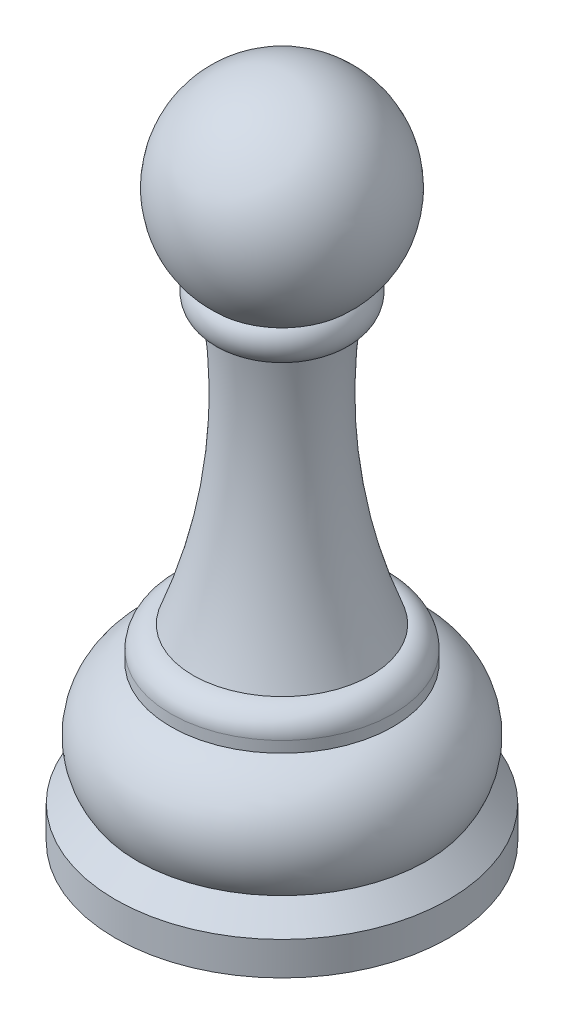
ISO-10303-21;
HEADER;
FILE_DESCRIPTION(('STEP AP214'),'2;1');
FILE_NAME('part.step','',(''),(''),'','','');
FILE_SCHEMA(('AUTOMOTIVE_DESIGN { 1 0 10303 214 1 1 1 1 }'));
ENDSEC;
DATA;
#1=APPLICATION_CONTEXT('core data for automotive mechanical design processes');
#2=APPLICATION_PROTOCOL_DEFINITION('international standard','automotive_design',2000,#1);
#3=PRODUCT_CONTEXT('',#1,'mechanical');
#4=PRODUCT('Part','Part','',(#3));
#5=PRODUCT_RELATED_PRODUCT_CATEGORY('part','',(#4));
#6=PRODUCT_DEFINITION_FORMATION('','',#4);
#7=PRODUCT_DEFINITION_CONTEXT('part definition',#1,'design');
#8=PRODUCT_DEFINITION('design','',#6,#7);
#9=PRODUCT_DEFINITION_SHAPE('','',#8);
#10=(LENGTH_UNIT() NAMED_UNIT(*) SI_UNIT(.MILLI.,.METRE.));
#11=(NAMED_UNIT(*) PLANE_ANGLE_UNIT() SI_UNIT($,.RADIAN.));
#12=(NAMED_UNIT(*) SI_UNIT($,.STERADIAN.) SOLID_ANGLE_UNIT());
#13=UNCERTAINTY_MEASURE_WITH_UNIT(LENGTH_MEASURE(1.E-05),#10,'distance_accuracy_value','');
#14=(GEOMETRIC_REPRESENTATION_CONTEXT(3) GLOBAL_UNCERTAINTY_ASSIGNED_CONTEXT((#13)) GLOBAL_UNIT_ASSIGNED_CONTEXT((#10,
#11,#12)) REPRESENTATION_CONTEXT('',''));
#15=CARTESIAN_POINT('',(0.,0.,0.));
#16=DIRECTION('',(0.,0.,1.));
#17=DIRECTION('',(1.,0.,0.));
#18=AXIS2_PLACEMENT_3D('',#15,#16,#17);
#19=CARTESIAN_POINT('',(0.,51.000000224209,0.0020089203871124));
#20=DIRECTION('',(-1.,0.,0.));
#21=DIRECTION('',(0.,0.,1.));
#22=AXIS2_PLACEMENT_3D('',#19,#20,#21);
#23=CIRCLE('',#22,9.);
#24=TRIMMED_CURVE('',#23,(PARAMETER_VALUE(-1.5710195401731)),(PARAMETER_VALUE(1.5710195401731)),
.T.,.PARAMETER.);
#25=CARTESIAN_POINT('',(0.,51.000000224209,0.));
#26=DIRECTION('',(0.,1.,0.));
#27=AXIS1_PLACEMENT('',#25,#26);
#28=SURFACE_OF_REVOLUTION('',#24,#27);
#29=CARTESIAN_POINT('',(0.,60.,0.));
#30=VERTEX_POINT('',#29);
#31=VERTEX_LOOP('',#30);
#32=FACE_BOUND('',#31,.T.);
#33=CARTESIAN_POINT('',(0.,44.29,0.));
#34=DIRECTION('',(0.,1.,0.));
#35=DIRECTION('',(0.,0.,1.));
#36=AXIS2_PLACEMENT_3D('',#33,#34,#35);
#37=CIRCLE('',#36,6.);
#38=CARTESIAN_POINT('',(0.,44.29,6.));
#39=VERTEX_POINT('',#38);
#40=EDGE_CURVE('E11',#39,#39,#37,.T.);
#41=ORIENTED_EDGE('',*,*,#40,.T.);
#42=EDGE_LOOP('',(#41));
#43=FACE_BOUND('',#42,.T.);
#44=ADVANCED_FACE('F34',(#32,#43),#28,.T.);
#45=CARTESIAN_POINT('',(0.,42.966609004825,0.));
#46=DIRECTION('',(0.,1.,0.));
#47=DIRECTION('',(0.,0.,1.));
#48=AXIS2_PLACEMENT_3D('',#45,#46,#47);
#49=TOROIDAL_SURFACE('',#48,4.50045464427058,2.);
#50=ORIENTED_EDGE('',*,*,#40,.F.);
#51=EDGE_LOOP('',(#50));
#52=FACE_BOUND('',#51,.T.);
#53=CARTESIAN_POINT('',(0.,41.03,0.));
#54=DIRECTION('',(0.,1.,0.));
#55=DIRECTION('',(0.,0.,1.));
#56=AXIS2_PLACEMENT_3D('',#53,#54,#55);
#57=CIRCLE('',#56,5.);
#58=CARTESIAN_POINT('',(0.,41.03,5.));
#59=VERTEX_POINT('',#58);
#60=EDGE_CURVE('E40',#59,#59,#57,.T.);
#61=ORIENTED_EDGE('',*,*,#60,.T.);
#62=EDGE_LOOP('',(#61));
#63=FACE_BOUND('',#62,.T.);
#64=ADVANCED_FACE('F45',(#52,#63),#49,.T.);
#65=CARTESIAN_POINT('',(0.,35.0019065796665,0.));
#66=DIRECTION('',(0.,1.,0.));
#67=DIRECTION('',(0.,0.,1.));
#68=AXIS2_PLACEMENT_3D('',#65,#66,#67);
#69=TOROIDAL_SURFACE('',#68,54.635290768925,50.);
#70=ORIENTED_EDGE('',*,*,#60,.F.);
#71=EDGE_LOOP('',(#70));
#72=FACE_BOUND('',#71,.T.);
#73=CARTESIAN_POINT('',(0.,16.97,0.));
#74=DIRECTION('',(0.,1.,0.));
#75=DIRECTION('',(0.,0.,1.));
#76=AXIS2_PLACEMENT_3D('',#73,#74,#75);
#77=CIRCLE('',#76,8.);
#78=CARTESIAN_POINT('',(0.,16.97,8.));
#79=VERTEX_POINT('',#78);
#80=EDGE_CURVE('E54',#79,#79,#77,.T.);
#81=ORIENTED_EDGE('',*,*,#80,.T.);
#82=EDGE_LOOP('',(#81));
#83=FACE_BOUND('',#82,.T.);
#84=ADVANCED_FACE('F50',(#72,#83),#69,.F.);
#85=CARTESIAN_POINT('',(0.,14.97,0.));
#86=DIRECTION('',(0.,1.,0.));
#87=DIRECTION('',(0.,0.,1.));
#88=AXIS2_PLACEMENT_3D('',#85,#86,#87);
#89=TOROIDAL_SURFACE('',#88,8.,2.);
#90=ORIENTED_EDGE('',*,*,#80,.F.);
#91=EDGE_LOOP('',(#90));
#92=FACE_BOUND('',#91,.T.);
#93=CARTESIAN_POINT('',(0.,14.97,0.));
#94=DIRECTION('',(0.,1.,0.));
#95=DIRECTION('',(0.,0.,1.));
#96=AXIS2_PLACEMENT_3D('',#93,#94,#95);
#97=CIRCLE('',#96,10.);
#98=CARTESIAN_POINT('',(0.,14.97,10.));
#99=VERTEX_POINT('',#98);
#100=EDGE_CURVE('E56',#99,#99,#97,.T.);
#101=ORIENTED_EDGE('',*,*,#100,.T.);
#102=EDGE_LOOP('',(#101));
#103=FACE_BOUND('',#102,.T.);
#104=ADVANCED_FACE('F96',(#92,#103),#89,.T.);
#105=CARTESIAN_POINT('',(0.,69.1181001809152,0.));
#106=DIRECTION('',(0.,1.,0.));
#107=DIRECTION('',(0.,0.,1.));
#108=AXIS2_PLACEMENT_3D('',#105,#106,#107);
#109=CYLINDRICAL_SURFACE('',#108,10.);
#110=ORIENTED_EDGE('',*,*,#100,.F.);
#111=EDGE_LOOP('',(#110));
#112=FACE_BOUND('',#111,.T.);
#113=CARTESIAN_POINT('',(0.,13.97,0.));
#114=DIRECTION('',(0.,1.,0.));
#115=DIRECTION('',(0.,0.,1.));
#116=AXIS2_PLACEMENT_3D('',#113,#114,#115);
#117=CIRCLE('',#116,10.);
#118=CARTESIAN_POINT('',(0.,13.97,10.));
#119=VERTEX_POINT('',#118);
#120=EDGE_CURVE('E61',#119,#119,#117,.T.);
#121=ORIENTED_EDGE('',*,*,#120,.T.);
#122=EDGE_LOOP('',(#121));
#123=FACE_BOUND('',#122,.T.);
#124=ADVANCED_FACE('F92',(#112,#123),#109,.T.);
#125=CARTESIAN_POINT('',(0.,8.31380661428568,0.));
#126=DIRECTION('',(0.,1.,0.));
#127=DIRECTION('',(0.,0.,1.));
#128=AXIS2_PLACEMENT_3D('',#125,#126,#127);
#129=TOROIDAL_SURFACE('',#128,7.99813177671417,6.);
#130=ORIENTED_EDGE('',*,*,#120,.F.);
#131=EDGE_LOOP('',(#130));
#132=FACE_BOUND('',#131,.T.);
#133=CARTESIAN_POINT('',(0.,5.,0.));
#134=DIRECTION('',(0.,1.,0.));
#135=DIRECTION('',(0.,0.,1.));
#136=AXIS2_PLACEMENT_3D('',#133,#134,#135);
#137=CIRCLE('',#136,13.);
#138=CARTESIAN_POINT('',(0.,5.,13.));
#139=VERTEX_POINT('',#138);
#140=EDGE_CURVE('E64',#139,#139,#137,.T.);
#141=ORIENTED_EDGE('',*,*,#140,.T.);
#142=EDGE_LOOP('',(#141));
#143=FACE_BOUND('',#142,.T.);
#144=ADVANCED_FACE('F88',(#132,#143),#129,.T.);
#145=CARTESIAN_POINT('',(0.,3.,0.));
#146=DIRECTION('',(0.,-1.,0.));
#147=DIRECTION('',(0.,0.,-1.));
#148=AXIS2_PLACEMENT_3D('',#145,#146,#147);
#149=CONICAL_SURFACE('',#148,15.,0.785398163397448);
#150=ORIENTED_EDGE('',*,*,#140,.F.);
#151=EDGE_LOOP('',(#150));
#152=FACE_BOUND('',#151,.T.);
#153=CARTESIAN_POINT('',(0.,3.,0.));
#154=DIRECTION('',(0.,1.,0.));
#155=DIRECTION('',(0.,0.,1.));
#156=AXIS2_PLACEMENT_3D('',#153,#154,#155);
#157=CIRCLE('',#156,15.);
#158=CARTESIAN_POINT('',(0.,3.,15.));
#159=VERTEX_POINT('',#158);
#160=EDGE_CURVE('E67',#159,#159,#157,.T.);
#161=ORIENTED_EDGE('',*,*,#160,.T.);
#162=EDGE_LOOP('',(#161));
#163=FACE_BOUND('',#162,.T.);
#164=ADVANCED_FACE('F82',(#152,#163),#149,.T.);
#165=CARTESIAN_POINT('',(0.,69.1181001809152,0.));
#166=DIRECTION('',(0.,1.,0.));
#167=DIRECTION('',(0.,0.,1.));
#168=AXIS2_PLACEMENT_3D('',#165,#166,#167);
#169=CYLINDRICAL_SURFACE('',#168,15.);
#170=ORIENTED_EDGE('',*,*,#160,.F.);
#171=EDGE_LOOP('',(#170));
#172=FACE_BOUND('',#171,.T.);
#173=CARTESIAN_POINT('',(0.,0.,0.));
#174=DIRECTION('',(0.,1.,0.));
#175=DIRECTION('',(0.,0.,1.));
#176=AXIS2_PLACEMENT_3D('',#173,#174,#175);
#177=CIRCLE('',#176,15.);
#178=CARTESIAN_POINT('',(0.,0.,15.));
#179=VERTEX_POINT('',#178);
#180=EDGE_CURVE('E70',#179,#179,#177,.T.);
#181=ORIENTED_EDGE('',*,*,#180,.T.);
#182=EDGE_LOOP('',(#181));
#183=FACE_BOUND('',#182,.T.);
#184=ADVANCED_FACE('F74',(#172,#183),#169,.T.);
#185=CARTESIAN_POINT('',(0.,0.,0.));
#186=DIRECTION('',(0.,1.,0.));
#187=DIRECTION('',(0.,0.,1.));
#188=AXIS2_PLACEMENT_3D('',#185,#186,#187);
#189=PLANE('',#188);
#190=ORIENTED_EDGE('',*,*,#180,.F.);
#191=EDGE_LOOP('',(#190));
#192=FACE_BOUND('',#191,.T.);
#193=ADVANCED_FACE('F76',(#192),#189,.F.);
#194=CLOSED_SHELL('',(#44,#64,#84,#104,#124,#144,#164,#184,#193));
#195=MANIFOLD_SOLID_BREP('B2',#194);
#196=ADVANCED_BREP_SHAPE_REPRESENTATION('',(#18,#195),#14);
#197=SHAPE_DEFINITION_REPRESENTATION(#9,#196);
ENDSEC;
END-ISO-10303-21;
